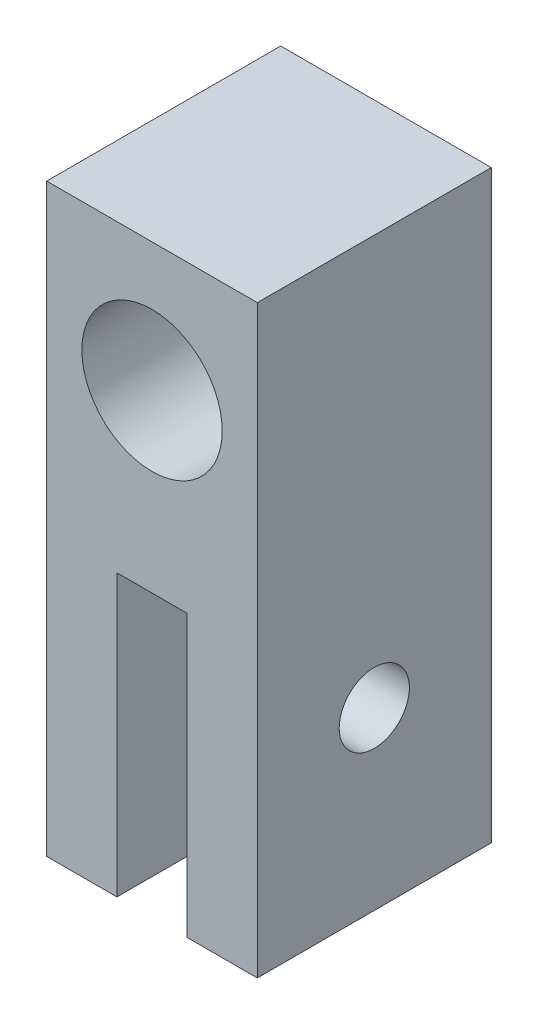
ISO-10303-21;
HEADER;
FILE_DESCRIPTION(('STEP AP214'),'2;1');
FILE_NAME('part.step','',(''),(''),'','','');
FILE_SCHEMA(('AUTOMOTIVE_DESIGN { 1 0 10303 214 1 1 1 1 }'));
ENDSEC;
DATA;
#1=APPLICATION_CONTEXT('core data for automotive mechanical design processes');
#2=APPLICATION_PROTOCOL_DEFINITION('international standard','automotive_design',2000,#1);
#3=PRODUCT_CONTEXT('',#1,'mechanical');
#4=PRODUCT('Part','Part','',(#3));
#5=PRODUCT_RELATED_PRODUCT_CATEGORY('part','',(#4));
#6=PRODUCT_DEFINITION_FORMATION('','',#4);
#7=PRODUCT_DEFINITION_CONTEXT('part definition',#1,'design');
#8=PRODUCT_DEFINITION('design','',#6,#7);
#9=PRODUCT_DEFINITION_SHAPE('','',#8);
#10=(LENGTH_UNIT() NAMED_UNIT(*) SI_UNIT(.MILLI.,.METRE.));
#11=(NAMED_UNIT(*) PLANE_ANGLE_UNIT() SI_UNIT($,.RADIAN.));
#12=(NAMED_UNIT(*) SI_UNIT($,.STERADIAN.) SOLID_ANGLE_UNIT());
#13=UNCERTAINTY_MEASURE_WITH_UNIT(LENGTH_MEASURE(1.E-05),#10,'distance_accuracy_value','');
#14=(GEOMETRIC_REPRESENTATION_CONTEXT(3) GLOBAL_UNCERTAINTY_ASSIGNED_CONTEXT((#13)) GLOBAL_UNIT_ASSIGNED_CONTEXT((#10,
#11,#12)) REPRESENTATION_CONTEXT('',''));
#15=CARTESIAN_POINT('',(0.,0.,0.));
#16=DIRECTION('',(0.,0.,1.));
#17=DIRECTION('',(1.,0.,0.));
#18=AXIS2_PLACEMENT_3D('',#15,#16,#17);
#19=CARTESIAN_POINT('',(-1.5,0.,10.));
#20=DIRECTION('',(-1.,0.,0.));
#21=DIRECTION('',(0.,0.,1.));
#22=AXIS2_PLACEMENT_3D('',#19,#20,#21);
#23=PLANE('',#22);
#24=CARTESIAN_POINT('',(-1.5,-5.,5.));
#25=DIRECTION('',(-1.,0.,0.));
#26=DIRECTION('',(0.,0.,1.));
#27=AXIS2_PLACEMENT_3D('',#24,#25,#26);
#28=CIRCLE('',#27,1.5);
#29=CARTESIAN_POINT('',(-1.5,-5.,6.5));
#30=VERTEX_POINT('',#29);
#31=EDGE_CURVE('E136',#30,#30,#28,.T.);
#32=ORIENTED_EDGE('',*,*,#31,.T.);
#33=EDGE_LOOP('',(#32));
#34=FACE_BOUND('',#33,.T.);
#35=DIRECTION('',(0.,1.,0.));
#36=VECTOR('',#35,1.);
#37=CARTESIAN_POINT('',(-1.5,0.,0.));
#38=LINE('',#37,#36);
#39=CARTESIAN_POINT('',(-1.5,-12.5,0.));
#40=VERTEX_POINT('',#39);
#41=CARTESIAN_POINT('',(-1.5,-0.5,0.));
#42=VERTEX_POINT('',#41);
#43=EDGE_CURVE('E135',#40,#42,#38,.T.);
#44=ORIENTED_EDGE('',*,*,#43,.T.);
#45=DIRECTION('',(0.,0.,-1.));
#46=VECTOR('',#45,1.);
#47=CARTESIAN_POINT('',(-1.5,-0.5,10.));
#48=LINE('',#47,#46);
#49=CARTESIAN_POINT('',(-1.5,-0.5,10.));
#50=VERTEX_POINT('',#49);
#51=EDGE_CURVE('E11',#50,#42,#48,.T.);
#52=ORIENTED_EDGE('',*,*,#51,.F.);
#53=DIRECTION('',(0.,1.,0.));
#54=VECTOR('',#53,1.);
#55=CARTESIAN_POINT('',(-1.5,0.,10.));
#56=LINE('',#55,#54);
#57=CARTESIAN_POINT('',(-1.5,-12.5,10.));
#58=VERTEX_POINT('',#57);
#59=EDGE_CURVE('E182',#58,#50,#56,.T.);
#60=ORIENTED_EDGE('',*,*,#59,.F.);
#61=DIRECTION('',(0.,0.,-1.));
#62=VECTOR('',#61,1.);
#63=CARTESIAN_POINT('',(-1.5,-12.5,10.));
#64=LINE('',#63,#62);
#65=EDGE_CURVE('E127',#58,#40,#64,.T.);
#66=ORIENTED_EDGE('',*,*,#65,.T.);
#67=EDGE_LOOP('',(#44,#52,#60,#66));
#68=FACE_BOUND('',#67,.T.);
#69=ADVANCED_FACE('F36',(#34,#68),#23,.F.);
#70=CARTESIAN_POINT('',(0.,-0.5,10.));
#71=DIRECTION('',(0.,1.,0.));
#72=DIRECTION('',(0.,0.,1.));
#73=AXIS2_PLACEMENT_3D('',#70,#71,#72);
#74=PLANE('',#73);
#75=DIRECTION('',(1.,0.,0.));
#76=VECTOR('',#75,1.);
#77=CARTESIAN_POINT('',(0.,-0.5,0.));
#78=LINE('',#77,#76);
#79=CARTESIAN_POINT('',(1.5,-0.5,0.));
#80=VERTEX_POINT('',#79);
#81=EDGE_CURVE('E139',#42,#80,#78,.T.);
#82=ORIENTED_EDGE('',*,*,#81,.T.);
#83=DIRECTION('',(0.,0.,-1.));
#84=VECTOR('',#83,1.);
#85=CARTESIAN_POINT('',(1.5,-0.5,10.));
#86=LINE('',#85,#84);
#87=CARTESIAN_POINT('',(1.5,-0.5,10.));
#88=VERTEX_POINT('',#87);
#89=EDGE_CURVE('E45',#88,#80,#86,.T.);
#90=ORIENTED_EDGE('',*,*,#89,.F.);
#91=DIRECTION('',(1.,0.,0.));
#92=VECTOR('',#91,1.);
#93=CARTESIAN_POINT('',(0.,-0.5,10.));
#94=LINE('',#93,#92);
#95=EDGE_CURVE('E92',#50,#88,#94,.T.);
#96=ORIENTED_EDGE('',*,*,#95,.F.);
#97=ORIENTED_EDGE('',*,*,#51,.T.);
#98=EDGE_LOOP('',(#82,#90,#96,#97));
#99=FACE_BOUND('',#98,.T.);
#100=ADVANCED_FACE('F166',(#99),#74,.F.);
#101=CARTESIAN_POINT('',(1.5,0.,10.));
#102=DIRECTION('',(-1.,0.,0.));
#103=DIRECTION('',(0.,0.,1.));
#104=AXIS2_PLACEMENT_3D('',#101,#102,#103);
#105=PLANE('',#104);
#106=CARTESIAN_POINT('',(1.5,-5.,5.));
#107=DIRECTION('',(-1.,0.,0.));
#108=DIRECTION('',(0.,0.,1.));
#109=AXIS2_PLACEMENT_3D('',#106,#107,#108);
#110=CIRCLE('',#109,1.5);
#111=CARTESIAN_POINT('',(1.5,-5.,6.5));
#112=VERTEX_POINT('',#111);
#113=EDGE_CURVE('E189',#112,#112,#110,.T.);
#114=ORIENTED_EDGE('',*,*,#113,.F.);
#115=EDGE_LOOP('',(#114));
#116=FACE_BOUND('',#115,.T.);
#117=DIRECTION('',(0.,1.,0.));
#118=VECTOR('',#117,1.);
#119=CARTESIAN_POINT('',(1.5,0.,0.));
#120=LINE('',#119,#118);
#121=CARTESIAN_POINT('',(1.5,-12.5,0.));
#122=VERTEX_POINT('',#121);
#123=EDGE_CURVE('E142',#122,#80,#120,.T.);
#124=ORIENTED_EDGE('',*,*,#123,.F.);
#125=DIRECTION('',(0.,0.,-1.));
#126=VECTOR('',#125,1.);
#127=CARTESIAN_POINT('',(1.5,-12.5,10.));
#128=LINE('',#127,#126);
#129=CARTESIAN_POINT('',(1.5,-12.5,10.));
#130=VERTEX_POINT('',#129);
#131=EDGE_CURVE('E159',#130,#122,#128,.T.);
#132=ORIENTED_EDGE('',*,*,#131,.F.);
#133=DIRECTION('',(0.,1.,0.));
#134=VECTOR('',#133,1.);
#135=CARTESIAN_POINT('',(1.5,0.,10.));
#136=LINE('',#135,#134);
#137=EDGE_CURVE('E165',#130,#88,#136,.T.);
#138=ORIENTED_EDGE('',*,*,#137,.T.);
#139=ORIENTED_EDGE('',*,*,#89,.T.);
#140=EDGE_LOOP('',(#124,#132,#138,#139));
#141=FACE_BOUND('',#140,.T.);
#142=ADVANCED_FACE('F163',(#116,#141),#105,.T.);
#143=CARTESIAN_POINT('',(0.,-12.5,10.));
#144=DIRECTION('',(0.,1.,0.));
#145=DIRECTION('',(0.,0.,1.));
#146=AXIS2_PLACEMENT_3D('',#143,#144,#145);
#147=PLANE('',#146);
#148=DIRECTION('',(1.,0.,0.));
#149=VECTOR('',#148,1.);
#150=CARTESIAN_POINT('',(0.,-12.5,0.));
#151=LINE('',#150,#149);
#152=CARTESIAN_POINT('',(4.5,-12.5,0.));
#153=VERTEX_POINT('',#152);
#154=EDGE_CURVE('E145',#122,#153,#151,.T.);
#155=ORIENTED_EDGE('',*,*,#154,.T.);
#156=DIRECTION('',(0.,0.,-1.));
#157=VECTOR('',#156,1.);
#158=CARTESIAN_POINT('',(4.5,-12.5,10.));
#159=LINE('',#158,#157);
#160=CARTESIAN_POINT('',(4.5,-12.5,10.));
#161=VERTEX_POINT('',#160);
#162=EDGE_CURVE('E156',#161,#153,#159,.T.);
#163=ORIENTED_EDGE('',*,*,#162,.F.);
#164=DIRECTION('',(1.,0.,0.));
#165=VECTOR('',#164,1.);
#166=CARTESIAN_POINT('',(0.,-12.5,10.));
#167=LINE('',#166,#165);
#168=EDGE_CURVE('E129',#130,#161,#167,.T.);
#169=ORIENTED_EDGE('',*,*,#168,.F.);
#170=ORIENTED_EDGE('',*,*,#131,.T.);
#171=EDGE_LOOP('',(#155,#163,#169,#170));
#172=FACE_BOUND('',#171,.T.);
#173=ADVANCED_FACE('F175',(#172),#147,.F.);
#174=CARTESIAN_POINT('',(4.5,0.,10.));
#175=DIRECTION('',(-1.,0.,0.));
#176=DIRECTION('',(0.,0.,1.));
#177=AXIS2_PLACEMENT_3D('',#174,#175,#176);
#178=PLANE('',#177);
#179=CARTESIAN_POINT('',(4.5,-5.,5.));
#180=DIRECTION('',(-1.,0.,0.));
#181=DIRECTION('',(0.,0.,1.));
#182=AXIS2_PLACEMENT_3D('',#179,#180,#181);
#183=CIRCLE('',#182,1.5);
#184=CARTESIAN_POINT('',(4.5,-5.,6.5));
#185=VERTEX_POINT('',#184);
#186=EDGE_CURVE('E192',#185,#185,#183,.T.);
#187=ORIENTED_EDGE('',*,*,#186,.T.);
#188=EDGE_LOOP('',(#187));
#189=FACE_BOUND('',#188,.T.);
#190=DIRECTION('',(0.,1.,0.));
#191=VECTOR('',#190,1.);
#192=CARTESIAN_POINT('',(4.5,0.,0.));
#193=LINE('',#192,#191);
#194=CARTESIAN_POINT('',(4.5,12.5,0.));
#195=VERTEX_POINT('',#194);
#196=EDGE_CURVE('E147',#153,#195,#193,.T.);
#197=ORIENTED_EDGE('',*,*,#196,.T.);
#198=DIRECTION('',(0.,0.,-1.));
#199=VECTOR('',#198,1.);
#200=CARTESIAN_POINT('',(4.5,12.5,10.));
#201=LINE('',#200,#199);
#202=CARTESIAN_POINT('',(4.5,12.5,10.));
#203=VERTEX_POINT('',#202);
#204=EDGE_CURVE('E117',#203,#195,#201,.T.);
#205=ORIENTED_EDGE('',*,*,#204,.F.);
#206=DIRECTION('',(0.,1.,0.));
#207=VECTOR('',#206,1.);
#208=CARTESIAN_POINT('',(4.5,0.,10.));
#209=LINE('',#208,#207);
#210=EDGE_CURVE('E122',#161,#203,#209,.T.);
#211=ORIENTED_EDGE('',*,*,#210,.F.);
#212=ORIENTED_EDGE('',*,*,#162,.T.);
#213=EDGE_LOOP('',(#197,#205,#211,#212));
#214=FACE_BOUND('',#213,.T.);
#215=ADVANCED_FACE('F178',(#189,#214),#178,.F.);
#216=CARTESIAN_POINT('',(0.,12.5,10.));
#217=DIRECTION('',(0.,1.,0.));
#218=DIRECTION('',(0.,0.,1.));
#219=AXIS2_PLACEMENT_3D('',#216,#217,#218);
#220=PLANE('',#219);
#221=DIRECTION('',(1.,0.,0.));
#222=VECTOR('',#221,1.);
#223=CARTESIAN_POINT('',(0.,12.5,0.));
#224=LINE('',#223,#222);
#225=CARTESIAN_POINT('',(-4.5,12.5,0.));
#226=VERTEX_POINT('',#225);
#227=EDGE_CURVE('E112',#226,#195,#224,.T.);
#228=ORIENTED_EDGE('',*,*,#227,.F.);
#229=DIRECTION('',(0.,0.,-1.));
#230=VECTOR('',#229,1.);
#231=CARTESIAN_POINT('',(-4.5,12.5,10.));
#232=LINE('',#231,#230);
#233=CARTESIAN_POINT('',(-4.5,12.5,10.));
#234=VERTEX_POINT('',#233);
#235=EDGE_CURVE('E107',#234,#226,#232,.T.);
#236=ORIENTED_EDGE('',*,*,#235,.F.);
#237=DIRECTION('',(1.,0.,0.));
#238=VECTOR('',#237,1.);
#239=CARTESIAN_POINT('',(0.,12.5,10.));
#240=LINE('',#239,#238);
#241=EDGE_CURVE('E110',#234,#203,#240,.T.);
#242=ORIENTED_EDGE('',*,*,#241,.T.);
#243=ORIENTED_EDGE('',*,*,#204,.T.);
#244=EDGE_LOOP('',(#228,#236,#242,#243));
#245=FACE_BOUND('',#244,.T.);
#246=ADVANCED_FACE('F109',(#245),#220,.T.);
#247=CARTESIAN_POINT('',(-4.5,0.,10.));
#248=DIRECTION('',(-1.,0.,0.));
#249=DIRECTION('',(0.,0.,1.));
#250=AXIS2_PLACEMENT_3D('',#247,#248,#249);
#251=PLANE('',#250);
#252=CARTESIAN_POINT('',(-4.5,-5.,5.));
#253=DIRECTION('',(1.,0.,0.));
#254=DIRECTION('',(0.,0.,-1.));
#255=AXIS2_PLACEMENT_3D('',#252,#253,#254);
#256=CIRCLE('',#255,1.5);
#257=CARTESIAN_POINT('',(-4.5,-5.,3.5));
#258=VERTEX_POINT('',#257);
#259=EDGE_CURVE('E195',#258,#258,#256,.T.);
#260=ORIENTED_EDGE('',*,*,#259,.T.);
#261=EDGE_LOOP('',(#260));
#262=FACE_BOUND('',#261,.T.);
#263=DIRECTION('',(0.,1.,0.));
#264=VECTOR('',#263,1.);
#265=CARTESIAN_POINT('',(-4.5,0.,0.));
#266=LINE('',#265,#264);
#267=CARTESIAN_POINT('',(-4.5,-12.5,0.));
#268=VERTEX_POINT('',#267);
#269=EDGE_CURVE('E151',#268,#226,#266,.T.);
#270=ORIENTED_EDGE('',*,*,#269,.F.);
#271=DIRECTION('',(0.,0.,-1.));
#272=VECTOR('',#271,1.);
#273=CARTESIAN_POINT('',(-4.5,-12.5,10.));
#274=LINE('',#273,#272);
#275=CARTESIAN_POINT('',(-4.5,-12.5,10.));
#276=VERTEX_POINT('',#275);
#277=EDGE_CURVE('E81',#276,#268,#274,.T.);
#278=ORIENTED_EDGE('',*,*,#277,.F.);
#279=DIRECTION('',(0.,1.,0.));
#280=VECTOR('',#279,1.);
#281=CARTESIAN_POINT('',(-4.5,0.,10.));
#282=LINE('',#281,#280);
#283=EDGE_CURVE('E120',#276,#234,#282,.T.);
#284=ORIENTED_EDGE('',*,*,#283,.T.);
#285=ORIENTED_EDGE('',*,*,#235,.T.);
#286=EDGE_LOOP('',(#270,#278,#284,#285));
#287=FACE_BOUND('',#286,.T.);
#288=ADVANCED_FACE('F125',(#262,#287),#251,.T.);
#289=CARTESIAN_POINT('',(0.,7.,10.));
#290=DIRECTION('',(0.,0.,-1.));
#291=DIRECTION('',(-1.,0.,0.));
#292=AXIS2_PLACEMENT_3D('',#289,#290,#291);
#293=CYLINDRICAL_SURFACE('',#292,3.);
#294=CARTESIAN_POINT('',(0.,7.,10.));
#295=DIRECTION('',(0.,0.,1.));
#296=DIRECTION('',(1.,0.,0.));
#297=AXIS2_PLACEMENT_3D('',#294,#295,#296);
#298=CIRCLE('',#297,3.);
#299=CARTESIAN_POINT('',(3.,7.,10.));
#300=VERTEX_POINT('',#299);
#301=EDGE_CURVE('E184',#300,#300,#298,.T.);
#302=ORIENTED_EDGE('',*,*,#301,.T.);
#303=EDGE_LOOP('',(#302));
#304=FACE_BOUND('',#303,.T.);
#305=CARTESIAN_POINT('',(0.,7.,0.));
#306=DIRECTION('',(0.,0.,1.));
#307=DIRECTION('',(1.,0.,0.));
#308=AXIS2_PLACEMENT_3D('',#305,#306,#307);
#309=CIRCLE('',#308,3.);
#310=CARTESIAN_POINT('',(3.,7.,0.));
#311=VERTEX_POINT('',#310);
#312=EDGE_CURVE('E132',#311,#311,#309,.T.);
#313=ORIENTED_EDGE('',*,*,#312,.F.);
#314=EDGE_LOOP('',(#313));
#315=FACE_BOUND('',#314,.T.);
#316=ADVANCED_FACE('F38',(#304,#315),#293,.F.);
#317=EDGE_CURVE('E84',#268,#40,#151,.T.);
#318=ORIENTED_EDGE('',*,*,#317,.T.);
#319=ORIENTED_EDGE('',*,*,#65,.F.);
#320=EDGE_CURVE('E53',#276,#58,#167,.T.);
#321=ORIENTED_EDGE('',*,*,#320,.F.);
#322=ORIENTED_EDGE('',*,*,#277,.T.);
#323=EDGE_LOOP('',(#318,#319,#321,#322));
#324=FACE_BOUND('',#323,.T.);
#325=ADVANCED_FACE('F210',(#324),#147,.F.);
#326=CARTESIAN_POINT('',(0.,0.,10.));
#327=DIRECTION('',(0.,0.,1.));
#328=DIRECTION('',(1.,0.,0.));
#329=AXIS2_PLACEMENT_3D('',#326,#327,#328);
#330=PLANE('',#329);
#331=ORIENTED_EDGE('',*,*,#301,.F.);
#332=EDGE_LOOP('',(#331));
#333=FACE_BOUND('',#332,.T.);
#334=ORIENTED_EDGE('',*,*,#59,.T.);
#335=ORIENTED_EDGE('',*,*,#95,.T.);
#336=ORIENTED_EDGE('',*,*,#137,.F.);
#337=ORIENTED_EDGE('',*,*,#168,.T.);
#338=ORIENTED_EDGE('',*,*,#210,.T.);
#339=ORIENTED_EDGE('',*,*,#241,.F.);
#340=ORIENTED_EDGE('',*,*,#283,.F.);
#341=ORIENTED_EDGE('',*,*,#320,.T.);
#342=EDGE_LOOP('',(#334,#335,#336,#337,#338,#339,#340,#341));
#343=FACE_BOUND('',#342,.T.);
#344=ADVANCED_FACE('F119',(#333,#343),#330,.T.);
#345=CARTESIAN_POINT('',(0.,0.,0.));
#346=DIRECTION('',(0.,0.,1.));
#347=DIRECTION('',(1.,0.,0.));
#348=AXIS2_PLACEMENT_3D('',#345,#346,#347);
#349=PLANE('',#348);
#350=ORIENTED_EDGE('',*,*,#312,.T.);
#351=EDGE_LOOP('',(#350));
#352=FACE_BOUND('',#351,.T.);
#353=ORIENTED_EDGE('',*,*,#43,.F.);
#354=ORIENTED_EDGE('',*,*,#317,.F.);
#355=ORIENTED_EDGE('',*,*,#269,.T.);
#356=ORIENTED_EDGE('',*,*,#227,.T.);
#357=ORIENTED_EDGE('',*,*,#196,.F.);
#358=ORIENTED_EDGE('',*,*,#154,.F.);
#359=ORIENTED_EDGE('',*,*,#123,.T.);
#360=ORIENTED_EDGE('',*,*,#81,.F.);
#361=EDGE_LOOP('',(#353,#354,#355,#356,#357,#358,#359,#360));
#362=FACE_BOUND('',#361,.T.);
#363=ADVANCED_FACE('F171',(#352,#362),#349,.F.);
#364=CARTESIAN_POINT('',(-4.5,-5.,5.));
#365=DIRECTION('',(1.,0.,0.));
#366=DIRECTION('',(0.,0.,-1.));
#367=AXIS2_PLACEMENT_3D('',#364,#365,#366);
#368=CYLINDRICAL_SURFACE('',#367,1.5);
#369=ORIENTED_EDGE('',*,*,#259,.F.);
#370=EDGE_LOOP('',(#369));
#371=FACE_BOUND('',#370,.T.);
#372=ORIENTED_EDGE('',*,*,#31,.F.);
#373=EDGE_LOOP('',(#372));
#374=FACE_BOUND('',#373,.T.);
#375=ADVANCED_FACE('F200',(#371,#374),#368,.F.);
#376=ORIENTED_EDGE('',*,*,#113,.T.);
#377=EDGE_LOOP('',(#376));
#378=FACE_BOUND('',#377,.T.);
#379=ORIENTED_EDGE('',*,*,#186,.F.);
#380=EDGE_LOOP('',(#379));
#381=FACE_BOUND('',#380,.T.);
#382=ADVANCED_FACE('F203',(#378,#381),#368,.F.);
#383=CLOSED_SHELL('',(#69,#100,#142,#173,#215,#246,#288,#316,#325,#344,#363,#375,#382));
#384=MANIFOLD_SOLID_BREP('B2',#383);
#385=ADVANCED_BREP_SHAPE_REPRESENTATION('',(#18,#384),#14);
#386=SHAPE_DEFINITION_REPRESENTATION(#9,#385);
ENDSEC;
END-ISO-10303-21;
